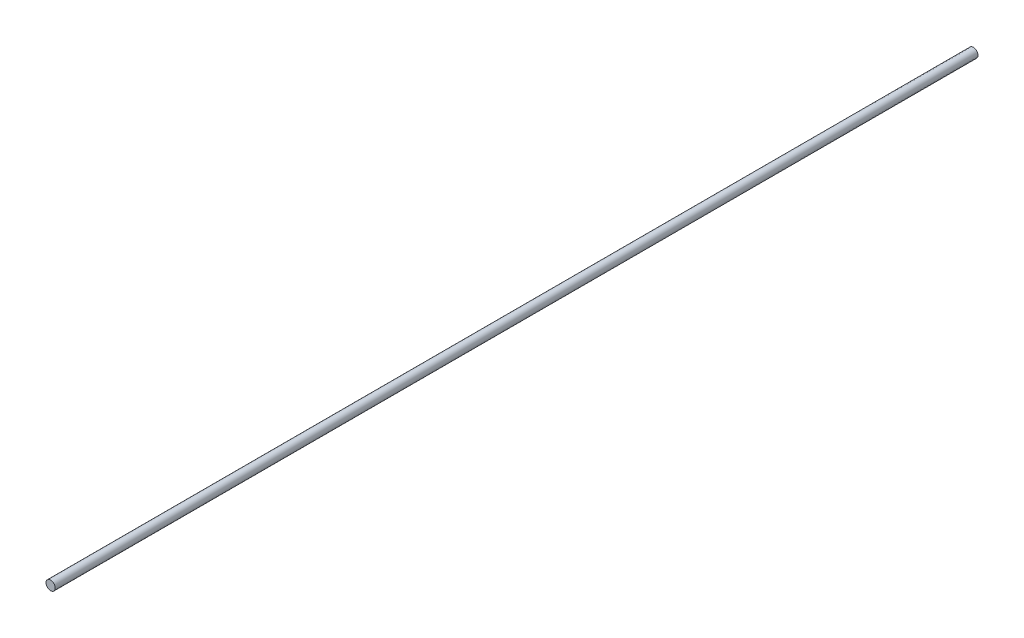
ISO-10303-21;
HEADER;
FILE_DESCRIPTION(('STEP AP214'),'2;1');
FILE_NAME('part.step','',(''),(''),'','','');
FILE_SCHEMA(('AUTOMOTIVE_DESIGN { 1 0 10303 214 1 1 1 1 }'));
ENDSEC;
DATA;
#1=APPLICATION_CONTEXT('core data for automotive mechanical design processes');
#2=APPLICATION_PROTOCOL_DEFINITION('international standard','automotive_design',2000,#1);
#3=PRODUCT_CONTEXT('',#1,'mechanical');
#4=PRODUCT('Part','Part','',(#3));
#5=PRODUCT_RELATED_PRODUCT_CATEGORY('part','',(#4));
#6=PRODUCT_DEFINITION_FORMATION('','',#4);
#7=PRODUCT_DEFINITION_CONTEXT('part definition',#1,'design');
#8=PRODUCT_DEFINITION('design','',#6,#7);
#9=PRODUCT_DEFINITION_SHAPE('','',#8);
#10=(LENGTH_UNIT() NAMED_UNIT(*) SI_UNIT(.MILLI.,.METRE.));
#11=(NAMED_UNIT(*) PLANE_ANGLE_UNIT() SI_UNIT($,.RADIAN.));
#12=(NAMED_UNIT(*) SI_UNIT($,.STERADIAN.) SOLID_ANGLE_UNIT());
#13=UNCERTAINTY_MEASURE_WITH_UNIT(LENGTH_MEASURE(1.E-05),#10,'distance_accuracy_value','');
#14=(GEOMETRIC_REPRESENTATION_CONTEXT(3) GLOBAL_UNCERTAINTY_ASSIGNED_CONTEXT((#13)) GLOBAL_UNIT_ASSIGNED_CONTEXT((#10,
#11,#12)) REPRESENTATION_CONTEXT('',''));
#15=CARTESIAN_POINT('',(0.,0.,0.));
#16=DIRECTION('',(0.,0.,1.));
#17=DIRECTION('',(1.,0.,0.));
#18=AXIS2_PLACEMENT_3D('',#15,#16,#17);
#19=CARTESIAN_POINT('',(0.,0.,190.5));
#20=DIRECTION('',(0.,0.,-1.));
#21=DIRECTION('',(-1.,0.,0.));
#22=AXIS2_PLACEMENT_3D('',#19,#20,#21);
#23=CYLINDRICAL_SURFACE('',#22,1.905);
#24=CARTESIAN_POINT('',(0.,0.,190.5));
#25=DIRECTION('',(0.,0.,1.));
#26=DIRECTION('',(1.,0.,0.));
#27=AXIS2_PLACEMENT_3D('',#24,#25,#26);
#28=CIRCLE('',#27,1.905);
#29=CARTESIAN_POINT('',(1.905,0.,190.5));
#30=VERTEX_POINT('',#29);
#31=EDGE_CURVE('E10',#30,#30,#28,.T.);
#32=ORIENTED_EDGE('',*,*,#31,.F.);
#33=EDGE_LOOP('',(#32));
#34=FACE_BOUND('',#33,.T.);
#35=CARTESIAN_POINT('',(0.,0.,-190.5));
#36=DIRECTION('',(0.,0.,1.));
#37=DIRECTION('',(1.,0.,0.));
#38=AXIS2_PLACEMENT_3D('',#35,#36,#37);
#39=CIRCLE('',#38,1.905);
#40=CARTESIAN_POINT('',(1.905,0.,-190.5));
#41=VERTEX_POINT('',#40);
#42=EDGE_CURVE('E39',#41,#41,#39,.T.);
#43=ORIENTED_EDGE('',*,*,#42,.T.);
#44=EDGE_LOOP('',(#43));
#45=FACE_BOUND('',#44,.T.);
#46=ADVANCED_FACE('F33',(#34,#45),#23,.T.);
#47=CARTESIAN_POINT('',(0.,0.,190.5));
#48=DIRECTION('',(0.,0.,1.));
#49=DIRECTION('',(1.,0.,0.));
#50=AXIS2_PLACEMENT_3D('',#47,#48,#49);
#51=PLANE('',#50);
#52=ORIENTED_EDGE('',*,*,#31,.T.);
#53=EDGE_LOOP('',(#52));
#54=FACE_BOUND('',#53,.T.);
#55=ADVANCED_FACE('F48',(#54),#51,.T.);
#56=CARTESIAN_POINT('',(0.,0.,-190.5));
#57=DIRECTION('',(0.,0.,1.));
#58=DIRECTION('',(1.,0.,0.));
#59=AXIS2_PLACEMENT_3D('',#56,#57,#58);
#60=PLANE('',#59);
#61=ORIENTED_EDGE('',*,*,#42,.F.);
#62=EDGE_LOOP('',(#61));
#63=FACE_BOUND('',#62,.T.);
#64=ADVANCED_FACE('F46',(#63),#60,.F.);
#65=CLOSED_SHELL('',(#46,#55,#64));
#66=MANIFOLD_SOLID_BREP('B2',#65);
#67=ADVANCED_BREP_SHAPE_REPRESENTATION('',(#18,#66),#14);
#68=SHAPE_DEFINITION_REPRESENTATION(#9,#67);
ENDSEC;
END-ISO-10303-21;
